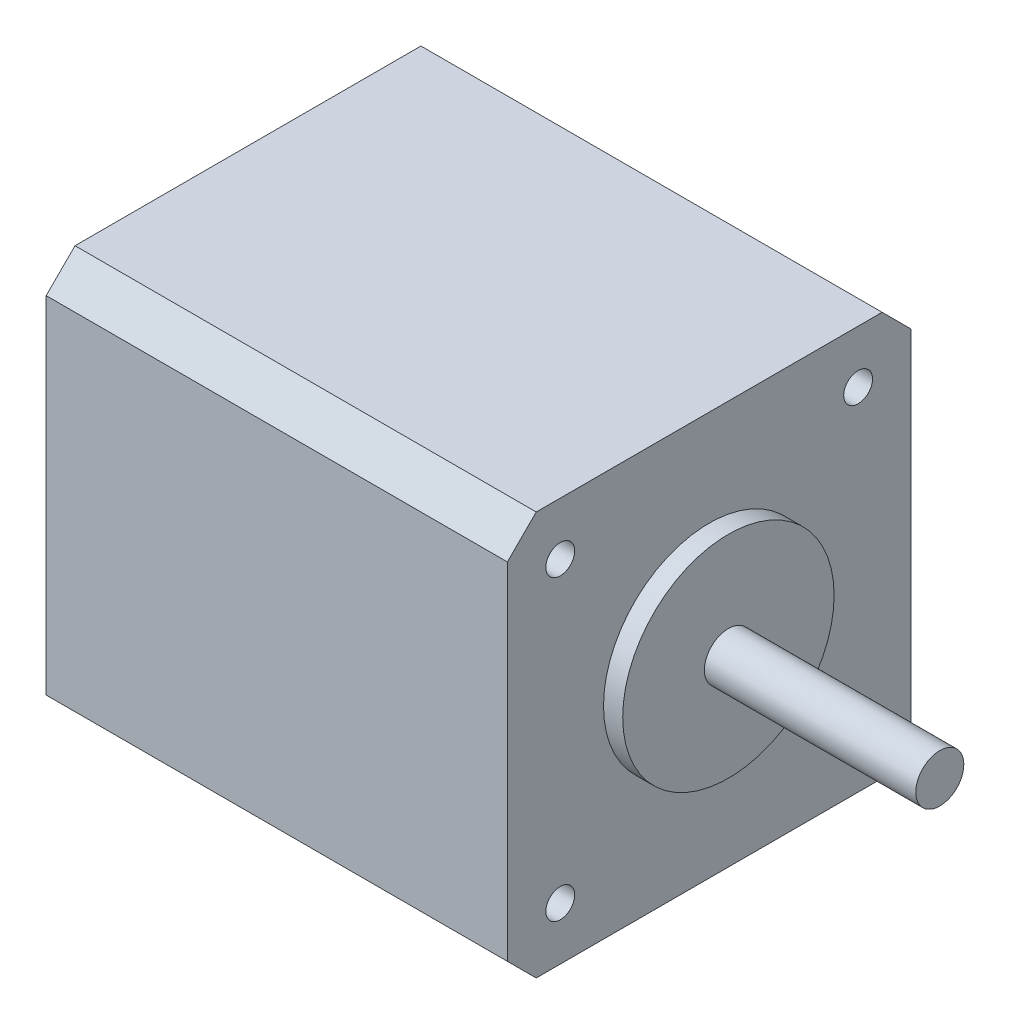
ISO-10303-21;
HEADER;
FILE_DESCRIPTION(('STEP AP214'),'2;1');
FILE_NAME('part.step','',(''),(''),'','','');
FILE_SCHEMA(('AUTOMOTIVE_DESIGN { 1 0 10303 214 1 1 1 1 }'));
ENDSEC;
DATA;
#1=APPLICATION_CONTEXT('core data for automotive mechanical design processes');
#2=APPLICATION_PROTOCOL_DEFINITION('international standard','automotive_design',2000,#1);
#3=PRODUCT_CONTEXT('',#1,'mechanical');
#4=PRODUCT('Part','Part','',(#3));
#5=PRODUCT_RELATED_PRODUCT_CATEGORY('part','',(#4));
#6=PRODUCT_DEFINITION_FORMATION('','',#4);
#7=PRODUCT_DEFINITION_CONTEXT('part definition',#1,'design');
#8=PRODUCT_DEFINITION('design','',#6,#7);
#9=PRODUCT_DEFINITION_SHAPE('','',#8);
#10=(LENGTH_UNIT() NAMED_UNIT(*) SI_UNIT(.MILLI.,.METRE.));
#11=(NAMED_UNIT(*) PLANE_ANGLE_UNIT() SI_UNIT($,.RADIAN.));
#12=(NAMED_UNIT(*) SI_UNIT($,.STERADIAN.) SOLID_ANGLE_UNIT());
#13=UNCERTAINTY_MEASURE_WITH_UNIT(LENGTH_MEASURE(1.E-05),#10,'distance_accuracy_value','');
#14=(GEOMETRIC_REPRESENTATION_CONTEXT(3) GLOBAL_UNCERTAINTY_ASSIGNED_CONTEXT((#13)) GLOBAL_UNIT_ASSIGNED_CONTEXT((#10,
#11,#12)) REPRESENTATION_CONTEXT('',''));
#15=CARTESIAN_POINT('',(0.,0.,0.));
#16=DIRECTION('',(0.,0.,1.));
#17=DIRECTION('',(1.,0.,0.));
#18=AXIS2_PLACEMENT_3D('',#15,#16,#17);
#19=CARTESIAN_POINT('',(185.,31.,0.));
#20=DIRECTION('',(1.,0.,0.));
#21=DIRECTION('',(0.,0.,-1.));
#22=AXIS2_PLACEMENT_3D('',#19,#20,#21);
#23=PLANE('',#22);
#24=CARTESIAN_POINT('',(185.,31.,0.));
#25=DIRECTION('',(1.,0.,0.));
#26=DIRECTION('',(0.,0.,-1.));
#27=AXIS2_PLACEMENT_3D('',#24,#25,#26);
#28=CIRCLE('',#27,11.);
#29=CARTESIAN_POINT('',(185.,31.,-11.));
#30=VERTEX_POINT('',#29);
#31=EDGE_CURVE('E194',#30,#30,#28,.T.);
#32=ORIENTED_EDGE('',*,*,#31,.T.);
#33=EDGE_LOOP('',(#32));
#34=FACE_BOUND('',#33,.T.);
#35=CARTESIAN_POINT('',(185.,31.,0.));
#36=DIRECTION('',(1.,0.,0.));
#37=DIRECTION('',(0.,0.,-1.));
#38=AXIS2_PLACEMENT_3D('',#35,#36,#37);
#39=CIRCLE('',#38,2.5);
#40=CARTESIAN_POINT('',(185.,31.,-2.5));
#41=VERTEX_POINT('',#40);
#42=EDGE_CURVE('E203',#41,#41,#39,.T.);
#43=ORIENTED_EDGE('',*,*,#42,.F.);
#44=EDGE_LOOP('',(#43));
#45=FACE_BOUND('',#44,.T.);
#46=ADVANCED_FACE('F32',(#34,#45),#23,.T.);
#47=CARTESIAN_POINT('',(183.,0.,0.));
#48=DIRECTION('',(1.,0.,0.));
#49=DIRECTION('',(0.,0.,-1.));
#50=AXIS2_PLACEMENT_3D('',#47,#48,#49);
#51=PLANE('',#50);
#52=CARTESIAN_POINT('',(183.,46.5,15.5));
#53=DIRECTION('',(-1.,0.,0.));
#54=DIRECTION('',(0.,0.,1.));
#55=AXIS2_PLACEMENT_3D('',#52,#53,#54);
#56=CIRCLE('',#55,1.5);
#57=CARTESIAN_POINT('',(183.,46.5,17.));
#58=VERTEX_POINT('',#57);
#59=EDGE_CURVE('E191',#58,#58,#56,.T.);
#60=ORIENTED_EDGE('',*,*,#59,.T.);
#61=EDGE_LOOP('',(#60));
#62=FACE_BOUND('',#61,.T.);
#63=CARTESIAN_POINT('',(183.,15.5,-15.5));
#64=DIRECTION('',(-1.,0.,0.));
#65=DIRECTION('',(0.,0.,1.));
#66=AXIS2_PLACEMENT_3D('',#63,#64,#65);
#67=CIRCLE('',#66,1.5);
#68=CARTESIAN_POINT('',(183.,15.5,-14.));
#69=VERTEX_POINT('',#68);
#70=EDGE_CURVE('E179',#69,#69,#67,.T.);
#71=ORIENTED_EDGE('',*,*,#70,.T.);
#72=EDGE_LOOP('',(#71));
#73=FACE_BOUND('',#72,.T.);
#74=DIRECTION('',(0.,0.,1.));
#75=VECTOR('',#74,1.);
#76=CARTESIAN_POINT('',(183.,52.,-21.));
#77=LINE('',#76,#75);
#78=CARTESIAN_POINT('',(183.,52.,-18.));
#79=VERTEX_POINT('',#78);
#80=CARTESIAN_POINT('',(183.,52.,18.));
#81=VERTEX_POINT('',#80);
#82=EDGE_CURVE('E102',#79,#81,#77,.T.);
#83=ORIENTED_EDGE('',*,*,#82,.T.);
#84=DIRECTION('',(0.,0.707106781186548,-0.707106781186547));
#85=VECTOR('',#84,1.);
#86=CARTESIAN_POINT('',(183.,34.9999999999999,35.));
#87=LINE('',#86,#85);
#88=CARTESIAN_POINT('',(183.,49.,21.));
#89=VERTEX_POINT('',#88);
#90=EDGE_CURVE('E135',#81,#89,#87,.F.);
#91=ORIENTED_EDGE('',*,*,#90,.T.);
#92=DIRECTION('',(0.,-1.,0.));
#93=VECTOR('',#92,1.);
#94=CARTESIAN_POINT('',(183.,52.,21.));
#95=LINE('',#94,#93);
#96=CARTESIAN_POINT('',(183.,13.,21.));
#97=VERTEX_POINT('',#96);
#98=EDGE_CURVE('E119',#89,#97,#95,.T.);
#99=ORIENTED_EDGE('',*,*,#98,.T.);
#100=DIRECTION('',(0.,-0.707106781186547,-0.707106781186548));
#101=VECTOR('',#100,1.);
#102=CARTESIAN_POINT('',(183.,-3.99999999999999,3.99999999999999));
#103=LINE('',#102,#101);
#104=CARTESIAN_POINT('',(183.,10.,18.));
#105=VERTEX_POINT('',#104);
#106=EDGE_CURVE('E133',#97,#105,#103,.T.);
#107=ORIENTED_EDGE('',*,*,#106,.T.);
#108=DIRECTION('',(0.,0.,1.));
#109=VECTOR('',#108,1.);
#110=CARTESIAN_POINT('',(183.,10.,-21.));
#111=LINE('',#110,#109);
#112=CARTESIAN_POINT('',(183.,10.,-18.));
#113=VERTEX_POINT('',#112);
#114=EDGE_CURVE('E163',#113,#105,#111,.T.);
#115=ORIENTED_EDGE('',*,*,#114,.F.);
#116=DIRECTION('',(0.,-0.707106781186548,0.707106781186547));
#117=VECTOR('',#116,1.);
#118=CARTESIAN_POINT('',(183.,-4.00000000000001,-4.00000000000002));
#119=LINE('',#118,#117);
#120=CARTESIAN_POINT('',(183.,13.,-21.));
#121=VERTEX_POINT('',#120);
#122=EDGE_CURVE('E109',#113,#121,#119,.F.);
#123=ORIENTED_EDGE('',*,*,#122,.T.);
#124=DIRECTION('',(0.,-1.,0.));
#125=VECTOR('',#124,1.);
#126=CARTESIAN_POINT('',(183.,52.,-21.));
#127=LINE('',#126,#125);
#128=CARTESIAN_POINT('',(183.,49.,-21.));
#129=VERTEX_POINT('',#128);
#130=EDGE_CURVE('E104',#129,#121,#127,.T.);
#131=ORIENTED_EDGE('',*,*,#130,.F.);
#132=DIRECTION('',(0.,0.707106781186544,0.707106781186551));
#133=VECTOR('',#132,1.);
#134=CARTESIAN_POINT('',(183.,35.0000000000002,-34.9999999999999));
#135=LINE('',#134,#133);
#136=EDGE_CURVE('E98',#129,#79,#135,.T.);
#137=ORIENTED_EDGE('',*,*,#136,.T.);
#138=EDGE_LOOP('',(#83,#91,#99,#107,#115,#123,#131,#137));
#139=FACE_BOUND('',#138,.T.);
#140=CARTESIAN_POINT('',(183.,46.5,-15.5));
#141=DIRECTION('',(-1.,0.,0.));
#142=DIRECTION('',(0.,0.,1.));
#143=AXIS2_PLACEMENT_3D('',#140,#141,#142);
#144=CIRCLE('',#143,1.5);
#145=CARTESIAN_POINT('',(183.,46.5,-14.));
#146=VERTEX_POINT('',#145);
#147=EDGE_CURVE('E173',#146,#146,#144,.T.);
#148=ORIENTED_EDGE('',*,*,#147,.T.);
#149=EDGE_LOOP('',(#148));
#150=FACE_BOUND('',#149,.T.);
#151=CARTESIAN_POINT('',(183.,15.5,15.5));
#152=DIRECTION('',(-1.,0.,0.));
#153=DIRECTION('',(0.,0.,1.));
#154=AXIS2_PLACEMENT_3D('',#151,#152,#153);
#155=CIRCLE('',#154,1.49999999999998);
#156=CARTESIAN_POINT('',(183.,15.5,17.));
#157=VERTEX_POINT('',#156);
#158=EDGE_CURVE('E185',#157,#157,#155,.T.);
#159=ORIENTED_EDGE('',*,*,#158,.T.);
#160=EDGE_LOOP('',(#159));
#161=FACE_BOUND('',#160,.T.);
#162=CARTESIAN_POINT('',(183.,31.,0.));
#163=DIRECTION('',(1.,0.,0.));
#164=DIRECTION('',(0.,0.,-1.));
#165=AXIS2_PLACEMENT_3D('',#162,#163,#164);
#166=CIRCLE('',#165,11.);
#167=CARTESIAN_POINT('',(183.,31.,-11.));
#168=VERTEX_POINT('',#167);
#169=EDGE_CURVE('E197',#168,#168,#166,.T.);
#170=ORIENTED_EDGE('',*,*,#169,.F.);
#171=EDGE_LOOP('',(#170));
#172=FACE_BOUND('',#171,.T.);
#173=ADVANCED_FACE('F100',(#62,#73,#139,#150,#161,#172),#51,.T.);
#174=CARTESIAN_POINT('',(135.,0.,0.));
#175=DIRECTION('',(1.,0.,0.));
#176=DIRECTION('',(0.,0.,-1.));
#177=AXIS2_PLACEMENT_3D('',#174,#175,#176);
#178=PLANE('',#177);
#179=CARTESIAN_POINT('',(135.,15.5,15.5));
#180=DIRECTION('',(-1.,0.,0.));
#181=DIRECTION('',(0.,0.,1.));
#182=AXIS2_PLACEMENT_3D('',#179,#180,#181);
#183=CIRCLE('',#182,1.49999999999998);
#184=CARTESIAN_POINT('',(135.,15.5,17.));
#185=VERTEX_POINT('',#184);
#186=EDGE_CURVE('E182',#185,#185,#183,.T.);
#187=ORIENTED_EDGE('',*,*,#186,.F.);
#188=EDGE_LOOP('',(#187));
#189=FACE_BOUND('',#188,.T.);
#190=CARTESIAN_POINT('',(135.,46.5,-15.5));
#191=DIRECTION('',(-1.,0.,0.));
#192=DIRECTION('',(0.,0.,1.));
#193=AXIS2_PLACEMENT_3D('',#190,#191,#192);
#194=CIRCLE('',#193,1.5);
#195=CARTESIAN_POINT('',(135.,46.5,-14.));
#196=VERTEX_POINT('',#195);
#197=EDGE_CURVE('E120',#196,#196,#194,.T.);
#198=ORIENTED_EDGE('',*,*,#197,.F.);
#199=EDGE_LOOP('',(#198));
#200=FACE_BOUND('',#199,.T.);
#201=DIRECTION('',(0.,-1.,0.));
#202=VECTOR('',#201,1.);
#203=CARTESIAN_POINT('',(135.,52.,21.));
#204=LINE('',#203,#202);
#205=CARTESIAN_POINT('',(135.,49.,21.));
#206=VERTEX_POINT('',#205);
#207=CARTESIAN_POINT('',(135.,13.,21.));
#208=VERTEX_POINT('',#207);
#209=EDGE_CURVE('E169',#206,#208,#204,.T.);
#210=ORIENTED_EDGE('',*,*,#209,.F.);
#211=DIRECTION('',(0.,-0.707106781186548,0.707106781186547));
#212=VECTOR('',#211,1.);
#213=CARTESIAN_POINT('',(135.,52.,18.));
#214=LINE('',#213,#212);
#215=CARTESIAN_POINT('',(135.,52.,18.));
#216=VERTEX_POINT('',#215);
#217=EDGE_CURVE('E146',#206,#216,#214,.F.);
#218=ORIENTED_EDGE('',*,*,#217,.T.);
#219=DIRECTION('',(0.,0.,1.));
#220=VECTOR('',#219,1.);
#221=CARTESIAN_POINT('',(135.,52.,-21.));
#222=LINE('',#221,#220);
#223=CARTESIAN_POINT('',(135.,52.,-18.));
#224=VERTEX_POINT('',#223);
#225=EDGE_CURVE('E165',#224,#216,#222,.T.);
#226=ORIENTED_EDGE('',*,*,#225,.F.);
#227=DIRECTION('',(0.,-0.707106781186544,-0.707106781186551));
#228=VECTOR('',#227,1.);
#229=CARTESIAN_POINT('',(135.,49.,-21.));
#230=LINE('',#229,#228);
#231=CARTESIAN_POINT('',(135.,49.,-21.));
#232=VERTEX_POINT('',#231);
#233=EDGE_CURVE('E123',#224,#232,#230,.T.);
#234=ORIENTED_EDGE('',*,*,#233,.T.);
#235=DIRECTION('',(0.,-1.,0.));
#236=VECTOR('',#235,1.);
#237=CARTESIAN_POINT('',(135.,52.,-21.));
#238=LINE('',#237,#236);
#239=CARTESIAN_POINT('',(135.,13.,-21.));
#240=VERTEX_POINT('',#239);
#241=EDGE_CURVE('E124',#232,#240,#238,.T.);
#242=ORIENTED_EDGE('',*,*,#241,.T.);
#243=DIRECTION('',(0.,0.707106781186548,-0.707106781186547));
#244=VECTOR('',#243,1.);
#245=CARTESIAN_POINT('',(135.,10.,-18.));
#246=LINE('',#245,#244);
#247=CARTESIAN_POINT('',(135.,10.,-18.));
#248=VERTEX_POINT('',#247);
#249=EDGE_CURVE('E54',#240,#248,#246,.F.);
#250=ORIENTED_EDGE('',*,*,#249,.T.);
#251=DIRECTION('',(0.,0.,1.));
#252=VECTOR('',#251,1.);
#253=CARTESIAN_POINT('',(135.,10.,-21.));
#254=LINE('',#253,#252);
#255=CARTESIAN_POINT('',(135.,9.99999999999999,18.));
#256=VERTEX_POINT('',#255);
#257=EDGE_CURVE('E127',#248,#256,#254,.T.);
#258=ORIENTED_EDGE('',*,*,#257,.T.);
#259=DIRECTION('',(0.,0.707106781186547,0.707106781186548));
#260=VECTOR('',#259,1.);
#261=CARTESIAN_POINT('',(135.,13.,21.));
#262=LINE('',#261,#260);
#263=EDGE_CURVE('E144',#256,#208,#262,.T.);
#264=ORIENTED_EDGE('',*,*,#263,.T.);
#265=EDGE_LOOP('',(#210,#218,#226,#234,#242,#250,#258,#264));
#266=FACE_BOUND('',#265,.T.);
#267=CARTESIAN_POINT('',(135.,15.5,-15.5));
#268=DIRECTION('',(-1.,0.,0.));
#269=DIRECTION('',(0.,0.,1.));
#270=AXIS2_PLACEMENT_3D('',#267,#268,#269);
#271=CIRCLE('',#270,1.5);
#272=CARTESIAN_POINT('',(135.,15.5,-14.));
#273=VERTEX_POINT('',#272);
#274=EDGE_CURVE('E176',#273,#273,#271,.T.);
#275=ORIENTED_EDGE('',*,*,#274,.F.);
#276=EDGE_LOOP('',(#275));
#277=FACE_BOUND('',#276,.T.);
#278=CARTESIAN_POINT('',(135.,46.5,15.5));
#279=DIRECTION('',(-1.,0.,0.));
#280=DIRECTION('',(0.,0.,1.));
#281=AXIS2_PLACEMENT_3D('',#278,#279,#280);
#282=CIRCLE('',#281,1.5);
#283=CARTESIAN_POINT('',(135.,46.5,17.));
#284=VERTEX_POINT('',#283);
#285=EDGE_CURVE('E188',#284,#284,#282,.T.);
#286=ORIENTED_EDGE('',*,*,#285,.F.);
#287=EDGE_LOOP('',(#286));
#288=FACE_BOUND('',#287,.T.);
#289=ADVANCED_FACE('F156',(#189,#200,#266,#277,#288),#178,.F.);
#290=CARTESIAN_POINT('',(135.,52.,-21.));
#291=DIRECTION('',(0.,1.,0.));
#292=DIRECTION('',(0.,0.,1.));
#293=AXIS2_PLACEMENT_3D('',#290,#291,#292);
#294=PLANE('',#293);
#295=ORIENTED_EDGE('',*,*,#225,.T.);
#296=DIRECTION('',(1.,0.,0.));
#297=VECTOR('',#296,1.);
#298=CARTESIAN_POINT('',(135.,52.,18.));
#299=LINE('',#298,#297);
#300=EDGE_CURVE('E110',#216,#81,#299,.T.);
#301=ORIENTED_EDGE('',*,*,#300,.T.);
#302=ORIENTED_EDGE('',*,*,#82,.F.);
#303=DIRECTION('',(-1.,0.,0.));
#304=VECTOR('',#303,1.);
#305=CARTESIAN_POINT('',(135.,52.,-18.));
#306=LINE('',#305,#304);
#307=EDGE_CURVE('E116',#79,#224,#306,.T.);
#308=ORIENTED_EDGE('',*,*,#307,.T.);
#309=EDGE_LOOP('',(#295,#301,#302,#308));
#310=FACE_BOUND('',#309,.T.);
#311=ADVANCED_FACE('F115',(#310),#294,.T.);
#312=CARTESIAN_POINT('',(135.,52.,-21.));
#313=DIRECTION('',(0.,0.,1.));
#314=DIRECTION('',(1.,0.,0.));
#315=AXIS2_PLACEMENT_3D('',#312,#313,#314);
#316=PLANE('',#315);
#317=ORIENTED_EDGE('',*,*,#130,.T.);
#318=DIRECTION('',(-1.,0.,0.));
#319=VECTOR('',#318,1.);
#320=CARTESIAN_POINT('',(135.,13.,-21.));
#321=LINE('',#320,#319);
#322=EDGE_CURVE('E11',#121,#240,#321,.T.);
#323=ORIENTED_EDGE('',*,*,#322,.T.);
#324=ORIENTED_EDGE('',*,*,#241,.F.);
#325=DIRECTION('',(1.,0.,0.));
#326=VECTOR('',#325,1.);
#327=CARTESIAN_POINT('',(183.,49.,-21.));
#328=LINE('',#327,#326);
#329=EDGE_CURVE('E40',#232,#129,#328,.T.);
#330=ORIENTED_EDGE('',*,*,#329,.T.);
#331=EDGE_LOOP('',(#317,#323,#324,#330));
#332=FACE_BOUND('',#331,.T.);
#333=ADVANCED_FACE('F153',(#332),#316,.F.);
#334=CARTESIAN_POINT('',(135.,10.,-21.));
#335=DIRECTION('',(0.,1.,0.));
#336=DIRECTION('',(0.,0.,1.));
#337=AXIS2_PLACEMENT_3D('',#334,#335,#336);
#338=PLANE('',#337);
#339=ORIENTED_EDGE('',*,*,#114,.T.);
#340=DIRECTION('',(-1.,0.,0.));
#341=VECTOR('',#340,1.);
#342=CARTESIAN_POINT('',(135.,10.,18.));
#343=LINE('',#342,#341);
#344=EDGE_CURVE('E47',#105,#256,#343,.T.);
#345=ORIENTED_EDGE('',*,*,#344,.T.);
#346=ORIENTED_EDGE('',*,*,#257,.F.);
#347=DIRECTION('',(1.,0.,0.));
#348=VECTOR('',#347,1.);
#349=CARTESIAN_POINT('',(135.,10.,-18.));
#350=LINE('',#349,#348);
#351=EDGE_CURVE('E148',#248,#113,#350,.T.);
#352=ORIENTED_EDGE('',*,*,#351,.T.);
#353=EDGE_LOOP('',(#339,#345,#346,#352));
#354=FACE_BOUND('',#353,.T.);
#355=ADVANCED_FACE('F162',(#354),#338,.F.);
#356=CARTESIAN_POINT('',(135.,52.,21.));
#357=DIRECTION('',(0.,0.,1.));
#358=DIRECTION('',(1.,0.,0.));
#359=AXIS2_PLACEMENT_3D('',#356,#357,#358);
#360=PLANE('',#359);
#361=ORIENTED_EDGE('',*,*,#98,.F.);
#362=DIRECTION('',(-1.,0.,0.));
#363=VECTOR('',#362,1.);
#364=CARTESIAN_POINT('',(135.,49.,21.));
#365=LINE('',#364,#363);
#366=EDGE_CURVE('E140',#89,#206,#365,.T.);
#367=ORIENTED_EDGE('',*,*,#366,.T.);
#368=ORIENTED_EDGE('',*,*,#209,.T.);
#369=DIRECTION('',(1.,0.,0.));
#370=VECTOR('',#369,1.);
#371=CARTESIAN_POINT('',(183.,13.,21.));
#372=LINE('',#371,#370);
#373=EDGE_CURVE('E137',#208,#97,#372,.T.);
#374=ORIENTED_EDGE('',*,*,#373,.T.);
#375=EDGE_LOOP('',(#361,#367,#368,#374));
#376=FACE_BOUND('',#375,.T.);
#377=ADVANCED_FACE('F247',(#376),#360,.T.);
#378=CARTESIAN_POINT('',(135.,46.5,-15.5));
#379=DIRECTION('',(1.,0.,0.));
#380=DIRECTION('',(0.,0.,-1.));
#381=AXIS2_PLACEMENT_3D('',#378,#379,#380);
#382=CYLINDRICAL_SURFACE('',#381,1.5);
#383=ORIENTED_EDGE('',*,*,#197,.T.);
#384=EDGE_LOOP('',(#383));
#385=FACE_BOUND('',#384,.T.);
#386=ORIENTED_EDGE('',*,*,#147,.F.);
#387=EDGE_LOOP('',(#386));
#388=FACE_BOUND('',#387,.T.);
#389=ADVANCED_FACE('F243',(#385,#388),#382,.F.);
#390=CARTESIAN_POINT('',(135.,15.5,-15.5));
#391=DIRECTION('',(1.,0.,0.));
#392=DIRECTION('',(0.,0.,-1.));
#393=AXIS2_PLACEMENT_3D('',#390,#391,#392);
#394=CYLINDRICAL_SURFACE('',#393,1.5);
#395=ORIENTED_EDGE('',*,*,#274,.T.);
#396=EDGE_LOOP('',(#395));
#397=FACE_BOUND('',#396,.T.);
#398=ORIENTED_EDGE('',*,*,#70,.F.);
#399=EDGE_LOOP('',(#398));
#400=FACE_BOUND('',#399,.T.);
#401=ADVANCED_FACE('F239',(#397,#400),#394,.F.);
#402=CARTESIAN_POINT('',(135.,15.5,15.5));
#403=DIRECTION('',(1.,0.,0.));
#404=DIRECTION('',(0.,0.,-1.));
#405=AXIS2_PLACEMENT_3D('',#402,#403,#404);
#406=CYLINDRICAL_SURFACE('',#405,1.49999999999998);
#407=ORIENTED_EDGE('',*,*,#186,.T.);
#408=EDGE_LOOP('',(#407));
#409=FACE_BOUND('',#408,.T.);
#410=ORIENTED_EDGE('',*,*,#158,.F.);
#411=EDGE_LOOP('',(#410));
#412=FACE_BOUND('',#411,.T.);
#413=ADVANCED_FACE('F235',(#409,#412),#406,.F.);
#414=CARTESIAN_POINT('',(135.,46.5,15.5));
#415=DIRECTION('',(1.,0.,0.));
#416=DIRECTION('',(0.,0.,-1.));
#417=AXIS2_PLACEMENT_3D('',#414,#415,#416);
#418=CYLINDRICAL_SURFACE('',#417,1.5);
#419=ORIENTED_EDGE('',*,*,#285,.T.);
#420=EDGE_LOOP('',(#419));
#421=FACE_BOUND('',#420,.T.);
#422=ORIENTED_EDGE('',*,*,#59,.F.);
#423=EDGE_LOOP('',(#422));
#424=FACE_BOUND('',#423,.T.);
#425=ADVANCED_FACE('F231',(#421,#424),#418,.F.);
#426=CARTESIAN_POINT('',(135.,52.,18.));
#427=DIRECTION('',(0.,-0.707106781186547,-0.707106781186548));
#428=DIRECTION('',(1.,0.,0.));
#429=AXIS2_PLACEMENT_3D('',#426,#427,#428);
#430=PLANE('',#429);
#431=ORIENTED_EDGE('',*,*,#217,.F.);
#432=ORIENTED_EDGE('',*,*,#366,.F.);
#433=ORIENTED_EDGE('',*,*,#90,.F.);
#434=ORIENTED_EDGE('',*,*,#300,.F.);
#435=EDGE_LOOP('',(#431,#432,#433,#434));
#436=FACE_BOUND('',#435,.T.);
#437=ADVANCED_FACE('F234',(#436),#430,.F.);
#438=CARTESIAN_POINT('',(135.,13.,21.));
#439=DIRECTION('',(0.,-0.707106781186548,0.707106781186547));
#440=DIRECTION('',(-1.,0.,0.));
#441=AXIS2_PLACEMENT_3D('',#438,#439,#440);
#442=PLANE('',#441);
#443=ORIENTED_EDGE('',*,*,#263,.F.);
#444=ORIENTED_EDGE('',*,*,#344,.F.);
#445=ORIENTED_EDGE('',*,*,#106,.F.);
#446=ORIENTED_EDGE('',*,*,#373,.F.);
#447=EDGE_LOOP('',(#443,#444,#445,#446));
#448=FACE_BOUND('',#447,.T.);
#449=ADVANCED_FACE('F263',(#448),#442,.T.);
#450=CARTESIAN_POINT('',(135.,10.,-18.));
#451=DIRECTION('',(0.,0.707106781186547,0.707106781186548));
#452=DIRECTION('',(1.,0.,0.));
#453=AXIS2_PLACEMENT_3D('',#450,#451,#452);
#454=PLANE('',#453);
#455=ORIENTED_EDGE('',*,*,#249,.F.);
#456=ORIENTED_EDGE('',*,*,#322,.F.);
#457=ORIENTED_EDGE('',*,*,#122,.F.);
#458=ORIENTED_EDGE('',*,*,#351,.F.);
#459=EDGE_LOOP('',(#455,#456,#457,#458));
#460=FACE_BOUND('',#459,.T.);
#461=ADVANCED_FACE('F160',(#460),#454,.F.);
#462=CARTESIAN_POINT('',(135.,49.,-21.));
#463=DIRECTION('',(0.,0.707106781186551,-0.707106781186544));
#464=DIRECTION('',(-1.,0.,0.));
#465=AXIS2_PLACEMENT_3D('',#462,#463,#464);
#466=PLANE('',#465);
#467=ORIENTED_EDGE('',*,*,#233,.F.);
#468=ORIENTED_EDGE('',*,*,#307,.F.);
#469=ORIENTED_EDGE('',*,*,#136,.F.);
#470=ORIENTED_EDGE('',*,*,#329,.F.);
#471=EDGE_LOOP('',(#467,#468,#469,#470));
#472=FACE_BOUND('',#471,.T.);
#473=ADVANCED_FACE('F34',(#472),#466,.T.);
#474=CARTESIAN_POINT('',(185.,31.,0.));
#475=DIRECTION('',(-1.,0.,0.));
#476=DIRECTION('',(0.,0.,1.));
#477=AXIS2_PLACEMENT_3D('',#474,#475,#476);
#478=CYLINDRICAL_SURFACE('',#477,11.);
#479=ORIENTED_EDGE('',*,*,#31,.F.);
#480=EDGE_LOOP('',(#479));
#481=FACE_BOUND('',#480,.T.);
#482=ORIENTED_EDGE('',*,*,#169,.T.);
#483=EDGE_LOOP('',(#482));
#484=FACE_BOUND('',#483,.T.);
#485=ADVANCED_FACE('F227',(#481,#484),#478,.T.);
#486=CARTESIAN_POINT('',(207.,31.,0.));
#487=DIRECTION('',(1.,0.,0.));
#488=DIRECTION('',(0.,0.,-1.));
#489=AXIS2_PLACEMENT_3D('',#486,#487,#488);
#490=PLANE('',#489);
#491=CARTESIAN_POINT('',(207.,31.,0.));
#492=DIRECTION('',(1.,0.,0.));
#493=DIRECTION('',(0.,0.,-1.));
#494=AXIS2_PLACEMENT_3D('',#491,#492,#493);
#495=CIRCLE('',#494,2.5);
#496=CARTESIAN_POINT('',(207.,31.,-2.5));
#497=VERTEX_POINT('',#496);
#498=EDGE_CURVE('E200',#497,#497,#495,.T.);
#499=ORIENTED_EDGE('',*,*,#498,.T.);
#500=EDGE_LOOP('',(#499));
#501=FACE_BOUND('',#500,.T.);
#502=ADVANCED_FACE('F209',(#501),#490,.T.);
#503=CARTESIAN_POINT('',(207.,31.,0.));
#504=DIRECTION('',(-1.,0.,0.));
#505=DIRECTION('',(0.,0.,1.));
#506=AXIS2_PLACEMENT_3D('',#503,#504,#505);
#507=CYLINDRICAL_SURFACE('',#506,2.5);
#508=ORIENTED_EDGE('',*,*,#498,.F.);
#509=EDGE_LOOP('',(#508));
#510=FACE_BOUND('',#509,.T.);
#511=ORIENTED_EDGE('',*,*,#42,.T.);
#512=EDGE_LOOP('',(#511));
#513=FACE_BOUND('',#512,.T.);
#514=ADVANCED_FACE('F211',(#510,#513),#507,.T.);
#515=CLOSED_SHELL('',(#46,#173,#289,#311,#333,#355,#377,#389,#401,#413,#425,#437,#449,#461,#473,
#485,#502,#514));
#516=MANIFOLD_SOLID_BREP('B2',#515);
#517=ADVANCED_BREP_SHAPE_REPRESENTATION('',(#18,#516),#14);
#518=SHAPE_DEFINITION_REPRESENTATION(#9,#517);
ENDSEC;
END-ISO-10303-21;
